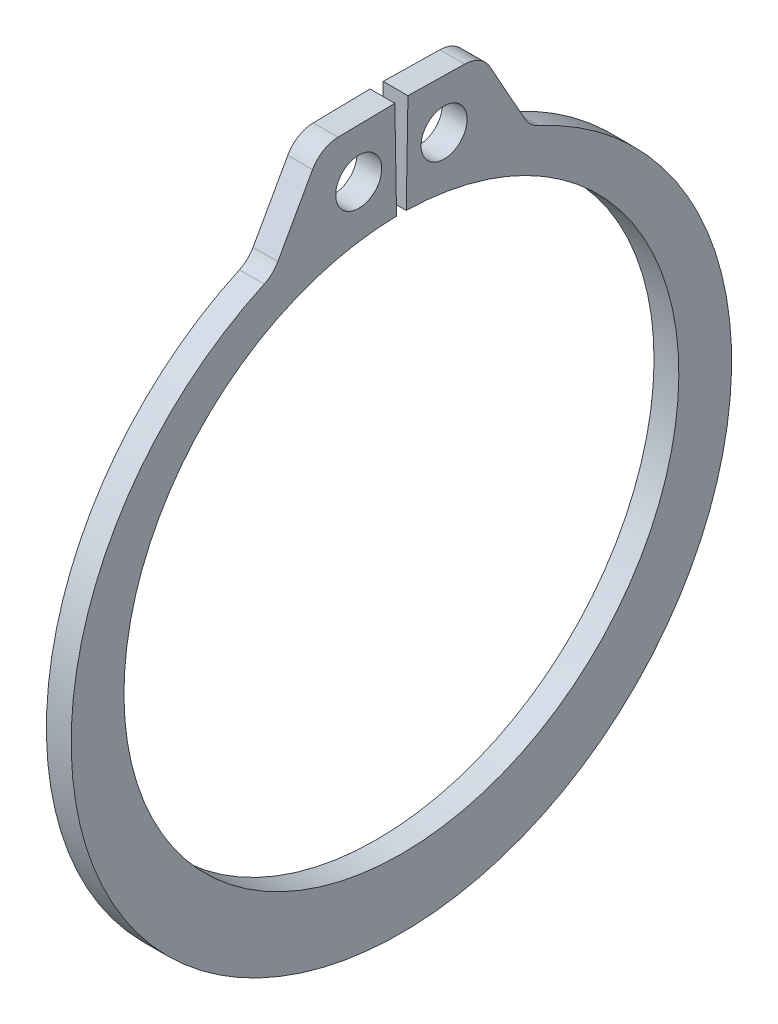
ISO-10303-21;
HEADER;
FILE_DESCRIPTION(('STEP AP214'),'2;1');
FILE_NAME('part.step','',(''),(''),'','','');
FILE_SCHEMA(('AUTOMOTIVE_DESIGN { 1 0 10303 214 1 1 1 1 }'));
ENDSEC;
DATA;
#1=APPLICATION_CONTEXT('core data for automotive mechanical design processes');
#2=APPLICATION_PROTOCOL_DEFINITION('international standard','automotive_design',2000,#1);
#3=PRODUCT_CONTEXT('',#1,'mechanical');
#4=PRODUCT('Part','Part','',(#3));
#5=PRODUCT_RELATED_PRODUCT_CATEGORY('part','',(#4));
#6=PRODUCT_DEFINITION_FORMATION('','',#4);
#7=PRODUCT_DEFINITION_CONTEXT('part definition',#1,'design');
#8=PRODUCT_DEFINITION('design','',#6,#7);
#9=PRODUCT_DEFINITION_SHAPE('','',#8);
#10=(LENGTH_UNIT() NAMED_UNIT(*) SI_UNIT(.MILLI.,.METRE.));
#11=(NAMED_UNIT(*) PLANE_ANGLE_UNIT() SI_UNIT($,.RADIAN.));
#12=(NAMED_UNIT(*) SI_UNIT($,.STERADIAN.) SOLID_ANGLE_UNIT());
#13=UNCERTAINTY_MEASURE_WITH_UNIT(LENGTH_MEASURE(1.E-05),#10,'distance_accuracy_value','');
#14=(GEOMETRIC_REPRESENTATION_CONTEXT(3) GLOBAL_UNCERTAINTY_ASSIGNED_CONTEXT((#13)) GLOBAL_UNIT_ASSIGNED_CONTEXT((#10,
#11,#12)) REPRESENTATION_CONTEXT('',''));
#15=CARTESIAN_POINT('',(0.,0.,0.));
#16=DIRECTION('',(0.,0.,1.));
#17=DIRECTION('',(1.,0.,0.));
#18=AXIS2_PLACEMENT_3D('',#15,#16,#17);
#19=CARTESIAN_POINT('',(0.5334,0.,0.));
#20=DIRECTION('',(1.,0.,0.));
#21=DIRECTION('',(0.,0.,-1.));
#22=AXIS2_PLACEMENT_3D('',#19,#20,#21);
#23=PLANE('',#22);
#24=CARTESIAN_POINT('',(0.5334,14.0289976548246,1.83579436935402));
#25=DIRECTION('',(1.,0.,0.));
#26=DIRECTION('',(0.,0.,-1.));
#27=AXIS2_PLACEMENT_3D('',#24,#25,#26);
#28=CIRCLE('',#27,0.9906);
#29=CARTESIAN_POINT('',(0.5334,14.0289976548246,0.84519436935402));
#30=VERTEX_POINT('',#29);
#31=EDGE_CURVE('E221',#30,#30,#28,.T.);
#32=ORIENTED_EDGE('',*,*,#31,.F.);
#33=EDGE_LOOP('',(#32));
#34=FACE_BOUND('',#33,.T.);
#35=DIRECTION('',(0.,-0.017452406437284,0.999847695156391));
#36=VECTOR('',#35,1.);
#37=CARTESIAN_POINT('',(0.5334,16.1773357380914,0.282376445673961));
#38=LINE('',#37,#36);
#39=CARTESIAN_POINT('',(0.5334,16.1773357380914,0.282376445673961));
#40=VERTEX_POINT('',#39);
#41=CARTESIAN_POINT('',(0.5334,16.1347155748455,2.72408396272631));
#42=VERTEX_POINT('',#41);
#43=EDGE_CURVE('E133',#40,#42,#38,.T.);
#44=ORIENTED_EDGE('',*,*,#43,.T.);
#45=CARTESIAN_POINT('',(0.5334,14.8522109362684,2.7016977609892));
#46=DIRECTION('',(1.,0.,0.));
#47=DIRECTION('',(0.,0.,-1.));
#48=AXIS2_PLACEMENT_3D('',#45,#46,#47);
#49=CIRCLE('',#48,1.2827);
#50=CARTESIAN_POINT('',(0.5334,15.4757773752687,3.82262781507487));
#51=VERTEX_POINT('',#50);
#52=EDGE_CURVE('E174',#42,#51,#49,.T.);
#53=ORIENTED_EDGE('',*,*,#52,.T.);
#54=DIRECTION('',(0.,-0.873883257258645,0.486135837686362));
#55=VECTOR('',#54,1.);
#56=CARTESIAN_POINT('',(0.5334,16.1218135248721,3.46324191065975));
#57=LINE('',#56,#55);
#58=CARTESIAN_POINT('',(0.5334,12.7919717875187,5.31561222317647));
#59=VERTEX_POINT('',#58);
#60=EDGE_CURVE('E213',#51,#59,#57,.T.);
#61=ORIENTED_EDGE('',*,*,#60,.T.);
#62=CARTESIAN_POINT('',(0.5334,13.415538226519,6.43654227726214));
#63=DIRECTION('',(1.,0.,0.));
#64=DIRECTION('',(0.,0.,-1.));
#65=AXIS2_PLACEMENT_3D('',#62,#63,#64);
#66=CIRCLE('',#65,1.2827);
#67=CARTESIAN_POINT('',(0.5334,12.2487956890074,5.90359655661022));
#68=VERTEX_POINT('',#67);
#69=EDGE_CURVE('E181',#59,#68,#66,.F.);
#70=ORIENTED_EDGE('',*,*,#69,.T.);
#71=CARTESIAN_POINT('',(0.5334,-0.675554690385856,0.));
#72=DIRECTION('',(1.,0.,0.));
#73=DIRECTION('',(0.,0.,-1.));
#74=AXIS2_PLACEMENT_3D('',#71,#72,#73);
#75=CIRCLE('',#74,14.2088453096141);
#76=CARTESIAN_POINT('',(0.5334,12.2487956890074,-5.90359655661022));
#77=VERTEX_POINT('',#76);
#78=EDGE_CURVE('E206',#68,#77,#75,.T.);
#79=ORIENTED_EDGE('',*,*,#78,.T.);
#80=CARTESIAN_POINT('',(0.5334,13.415538226519,-6.43654227726214));
#81=DIRECTION('',(1.,0.,0.));
#82=DIRECTION('',(0.,0.,-1.));
#83=AXIS2_PLACEMENT_3D('',#80,#81,#82);
#84=CIRCLE('',#83,1.2827);
#85=CARTESIAN_POINT('',(0.5334,12.7919717875187,-5.31561222317647));
#86=VERTEX_POINT('',#85);
#87=EDGE_CURVE('E11',#77,#86,#84,.F.);
#88=ORIENTED_EDGE('',*,*,#87,.T.);
#89=DIRECTION('',(0.,0.873883257258645,0.486135837686362));
#90=VECTOR('',#89,1.);
#91=CARTESIAN_POINT('',(0.5334,16.1218135248721,-3.46324191065975));
#92=LINE('',#91,#90);
#93=CARTESIAN_POINT('',(0.5334,15.4757773752687,-3.82262781507487));
#94=VERTEX_POINT('',#93);
#95=EDGE_CURVE('E205',#86,#94,#92,.T.);
#96=ORIENTED_EDGE('',*,*,#95,.T.);
#97=CARTESIAN_POINT('',(0.5334,14.8522109362684,-2.7016977609892));
#98=DIRECTION('',(1.,0.,0.));
#99=DIRECTION('',(0.,0.,-1.));
#100=AXIS2_PLACEMENT_3D('',#97,#98,#99);
#101=CIRCLE('',#100,1.2827);
#102=CARTESIAN_POINT('',(0.5334,16.1347155748455,-2.72408396272631));
#103=VERTEX_POINT('',#102);
#104=EDGE_CURVE('E49',#94,#103,#101,.T.);
#105=ORIENTED_EDGE('',*,*,#104,.T.);
#106=DIRECTION('',(0.,0.017452406437284,0.999847695156391));
#107=VECTOR('',#106,1.);
#108=CARTESIAN_POINT('',(0.5334,16.1773357380914,-0.282376445673961));
#109=LINE('',#108,#107);
#110=CARTESIAN_POINT('',(0.5334,16.1773357380914,-0.282376445673961));
#111=VERTEX_POINT('',#110);
#112=EDGE_CURVE('E210',#103,#111,#109,.T.);
#113=ORIENTED_EDGE('',*,*,#112,.T.);
#114=DIRECTION('',(0.,-0.999847695156391,0.0174524064372835));
#115=VECTOR('',#114,1.);
#116=CARTESIAN_POINT('',(0.5334,11.936181784777,-0.208346828048291));
#117=LINE('',#116,#115);
#118=CARTESIAN_POINT('',(0.5334,11.936181784777,-0.208346828048291));
#119=VERTEX_POINT('',#118);
#120=EDGE_CURVE('E139',#111,#119,#117,.T.);
#121=ORIENTED_EDGE('',*,*,#120,.T.);
#122=CARTESIAN_POINT('',(0.5334,0.,0.));
#123=DIRECTION('',(-1.,0.,0.));
#124=DIRECTION('',(0.,0.,-1.));
#125=AXIS2_PLACEMENT_3D('',#122,#123,#124);
#126=CIRCLE('',#125,11.938);
#127=CARTESIAN_POINT('',(0.5334,11.936181784777,0.208346828048291));
#128=VERTEX_POINT('',#127);
#129=EDGE_CURVE('E134',#119,#128,#126,.T.);
#130=ORIENTED_EDGE('',*,*,#129,.T.);
#131=DIRECTION('',(0.,0.999847695156391,0.0174524064372835));
#132=VECTOR('',#131,1.);
#133=CARTESIAN_POINT('',(0.5334,11.936181784777,0.208346828048291));
#134=LINE('',#133,#132);
#135=EDGE_CURVE('E125',#128,#40,#134,.T.);
#136=ORIENTED_EDGE('',*,*,#135,.T.);
#137=EDGE_LOOP('',(#44,#53,#61,#70,#79,#88,#96,#105,#113,#121,#130,#136));
#138=FACE_BOUND('',#137,.T.);
#139=CARTESIAN_POINT('',(0.5334,14.0289976548246,-1.83579436935402));
#140=DIRECTION('',(1.,0.,0.));
#141=DIRECTION('',(0.,0.,-1.));
#142=AXIS2_PLACEMENT_3D('',#139,#140,#141);
#143=CIRCLE('',#142,0.990600000000001);
#144=CARTESIAN_POINT('',(0.5334,14.0289976548246,-2.82639436935402));
#145=VERTEX_POINT('',#144);
#146=EDGE_CURVE('E247',#145,#145,#143,.T.);
#147=ORIENTED_EDGE('',*,*,#146,.F.);
#148=EDGE_LOOP('',(#147));
#149=FACE_BOUND('',#148,.T.);
#150=ADVANCED_FACE('F34',(#34,#138,#149),#23,.T.);
#151=CARTESIAN_POINT('',(-0.5334,0.,0.));
#152=DIRECTION('',(1.,0.,0.));
#153=DIRECTION('',(0.,0.,-1.));
#154=AXIS2_PLACEMENT_3D('',#151,#152,#153);
#155=PLANE('',#154);
#156=CARTESIAN_POINT('',(-0.5334,14.0289976548246,1.83579436935402));
#157=DIRECTION('',(1.,0.,0.));
#158=DIRECTION('',(0.,0.,-1.));
#159=AXIS2_PLACEMENT_3D('',#156,#157,#158);
#160=CIRCLE('',#159,0.9906);
#161=CARTESIAN_POINT('',(-0.5334,14.0289976548246,0.84519436935402));
#162=VERTEX_POINT('',#161);
#163=EDGE_CURVE('E244',#162,#162,#160,.T.);
#164=ORIENTED_EDGE('',*,*,#163,.T.);
#165=EDGE_LOOP('',(#164));
#166=FACE_BOUND('',#165,.T.);
#167=DIRECTION('',(0.,-0.873883257258645,0.486135837686362));
#168=VECTOR('',#167,1.);
#169=CARTESIAN_POINT('',(-0.5334,16.1218135248721,3.46324191065975));
#170=LINE('',#169,#168);
#171=CARTESIAN_POINT('',(-0.5334,15.4757773752687,3.82262781507487));
#172=VERTEX_POINT('',#171);
#173=CARTESIAN_POINT('',(-0.5334,12.7919717875187,5.31561222317647));
#174=VERTEX_POINT('',#173);
#175=EDGE_CURVE('E200',#172,#174,#170,.T.);
#176=ORIENTED_EDGE('',*,*,#175,.F.);
#177=CARTESIAN_POINT('',(-0.5334,14.8522109362684,2.7016977609892));
#178=DIRECTION('',(1.,0.,0.));
#179=DIRECTION('',(0.,0.,-1.));
#180=AXIS2_PLACEMENT_3D('',#177,#178,#179);
#181=CIRCLE('',#180,1.2827);
#182=CARTESIAN_POINT('',(-0.5334,16.1347155748455,2.72408396272631));
#183=VERTEX_POINT('',#182);
#184=EDGE_CURVE('E170',#172,#183,#181,.F.);
#185=ORIENTED_EDGE('',*,*,#184,.T.);
#186=DIRECTION('',(0.,-0.017452406437284,0.999847695156391));
#187=VECTOR('',#186,1.);
#188=CARTESIAN_POINT('',(-0.5334,16.1773357380914,0.282376445673961));
#189=LINE('',#188,#187);
#190=CARTESIAN_POINT('',(-0.5334,16.1773357380914,0.282376445673961));
#191=VERTEX_POINT('',#190);
#192=EDGE_CURVE('E223',#191,#183,#189,.T.);
#193=ORIENTED_EDGE('',*,*,#192,.F.);
#194=DIRECTION('',(0.,0.999847695156391,0.0174524064372835));
#195=VECTOR('',#194,1.);
#196=CARTESIAN_POINT('',(-0.5334,11.936181784777,0.208346828048291));
#197=LINE('',#196,#195);
#198=CARTESIAN_POINT('',(-0.5334,11.936181784777,0.208346828048291));
#199=VERTEX_POINT('',#198);
#200=EDGE_CURVE('E220',#199,#191,#197,.T.);
#201=ORIENTED_EDGE('',*,*,#200,.F.);
#202=CARTESIAN_POINT('',(-0.5334,0.,0.));
#203=DIRECTION('',(-1.,0.,0.));
#204=DIRECTION('',(0.,0.,-1.));
#205=AXIS2_PLACEMENT_3D('',#202,#203,#204);
#206=CIRCLE('',#205,11.938);
#207=CARTESIAN_POINT('',(-0.5334,11.936181784777,-0.208346828048291));
#208=VERTEX_POINT('',#207);
#209=EDGE_CURVE('E147',#208,#199,#206,.T.);
#210=ORIENTED_EDGE('',*,*,#209,.F.);
#211=DIRECTION('',(0.,-0.999847695156391,0.0174524064372835));
#212=VECTOR('',#211,1.);
#213=CARTESIAN_POINT('',(-0.5334,11.936181784777,-0.208346828048291));
#214=LINE('',#213,#212);
#215=CARTESIAN_POINT('',(-0.5334,16.1773357380914,-0.282376445673961));
#216=VERTEX_POINT('',#215);
#217=EDGE_CURVE('E143',#216,#208,#214,.T.);
#218=ORIENTED_EDGE('',*,*,#217,.F.);
#219=DIRECTION('',(0.,0.017452406437284,0.999847695156391));
#220=VECTOR('',#219,1.);
#221=CARTESIAN_POINT('',(-0.5334,16.1773357380914,-0.282376445673961));
#222=LINE('',#221,#220);
#223=CARTESIAN_POINT('',(-0.5334,16.1347155748455,-2.72408396272631));
#224=VERTEX_POINT('',#223);
#225=EDGE_CURVE('E228',#224,#216,#222,.T.);
#226=ORIENTED_EDGE('',*,*,#225,.F.);
#227=CARTESIAN_POINT('',(-0.5334,14.8522109362684,-2.7016977609892));
#228=DIRECTION('',(1.,0.,0.));
#229=DIRECTION('',(0.,0.,-1.));
#230=AXIS2_PLACEMENT_3D('',#227,#228,#229);
#231=CIRCLE('',#230,1.2827);
#232=CARTESIAN_POINT('',(-0.5334,15.4757773752687,-3.82262781507487));
#233=VERTEX_POINT('',#232);
#234=EDGE_CURVE('E168',#224,#233,#231,.F.);
#235=ORIENTED_EDGE('',*,*,#234,.T.);
#236=DIRECTION('',(0.,0.873883257258645,0.486135837686362));
#237=VECTOR('',#236,1.);
#238=CARTESIAN_POINT('',(-0.5334,16.1218135248721,-3.46324191065975));
#239=LINE('',#238,#237);
#240=CARTESIAN_POINT('',(-0.5334,12.7919717875187,-5.31561222317647));
#241=VERTEX_POINT('',#240);
#242=EDGE_CURVE('E191',#241,#233,#239,.T.);
#243=ORIENTED_EDGE('',*,*,#242,.F.);
#244=CARTESIAN_POINT('',(-0.5334,13.415538226519,-6.43654227726214));
#245=DIRECTION('',(1.,0.,0.));
#246=DIRECTION('',(0.,0.,-1.));
#247=AXIS2_PLACEMENT_3D('',#244,#245,#246);
#248=CIRCLE('',#247,1.2827);
#249=CARTESIAN_POINT('',(-0.5334,12.2487956890074,-5.90359655661022));
#250=VERTEX_POINT('',#249);
#251=EDGE_CURVE('E42',#241,#250,#248,.T.);
#252=ORIENTED_EDGE('',*,*,#251,.T.);
#253=CARTESIAN_POINT('',(-0.5334,-0.675554690385856,0.));
#254=DIRECTION('',(1.,0.,0.));
#255=DIRECTION('',(0.,0.,-1.));
#256=AXIS2_PLACEMENT_3D('',#253,#254,#255);
#257=CIRCLE('',#256,14.2088453096141);
#258=CARTESIAN_POINT('',(-0.5334,12.2487956890074,5.90359655661022));
#259=VERTEX_POINT('',#258);
#260=EDGE_CURVE('E189',#259,#250,#257,.T.);
#261=ORIENTED_EDGE('',*,*,#260,.F.);
#262=CARTESIAN_POINT('',(-0.5334,13.415538226519,6.43654227726214));
#263=DIRECTION('',(1.,0.,0.));
#264=DIRECTION('',(0.,0.,-1.));
#265=AXIS2_PLACEMENT_3D('',#262,#263,#264);
#266=CIRCLE('',#265,1.2827);
#267=EDGE_CURVE('E179',#259,#174,#266,.T.);
#268=ORIENTED_EDGE('',*,*,#267,.T.);
#269=EDGE_LOOP('',(#176,#185,#193,#201,#210,#218,#226,#235,#243,#252,#261,#268));
#270=FACE_BOUND('',#269,.T.);
#271=CARTESIAN_POINT('',(-0.5334,14.0289976548246,-1.83579436935402));
#272=DIRECTION('',(1.,0.,0.));
#273=DIRECTION('',(0.,0.,-1.));
#274=AXIS2_PLACEMENT_3D('',#271,#272,#273);
#275=CIRCLE('',#274,0.990600000000001);
#276=CARTESIAN_POINT('',(-0.5334,14.0289976548246,-2.82639436935402));
#277=VERTEX_POINT('',#276);
#278=EDGE_CURVE('E250',#277,#277,#275,.T.);
#279=ORIENTED_EDGE('',*,*,#278,.T.);
#280=EDGE_LOOP('',(#279));
#281=FACE_BOUND('',#280,.T.);
#282=ADVANCED_FACE('F187',(#166,#270,#281),#155,.F.);
#283=CARTESIAN_POINT('',(0.5334,0.,0.));
#284=DIRECTION('',(-1.,0.,0.));
#285=DIRECTION('',(0.,0.,1.));
#286=AXIS2_PLACEMENT_3D('',#283,#284,#285);
#287=CYLINDRICAL_SURFACE('',#286,11.938);
#288=ORIENTED_EDGE('',*,*,#209,.T.);
#289=DIRECTION('',(-1.,0.,0.));
#290=VECTOR('',#289,1.);
#291=CARTESIAN_POINT('',(0.5334,11.936181784777,0.208346828048291));
#292=LINE('',#291,#290);
#293=EDGE_CURVE('E129',#128,#199,#292,.T.);
#294=ORIENTED_EDGE('',*,*,#293,.F.);
#295=ORIENTED_EDGE('',*,*,#129,.F.);
#296=DIRECTION('',(-1.,0.,0.));
#297=VECTOR('',#296,1.);
#298=CARTESIAN_POINT('',(0.5334,11.936181784777,-0.208346828048291));
#299=LINE('',#298,#297);
#300=EDGE_CURVE('E218',#119,#208,#299,.T.);
#301=ORIENTED_EDGE('',*,*,#300,.T.);
#302=EDGE_LOOP('',(#288,#294,#295,#301));
#303=FACE_BOUND('',#302,.T.);
#304=ADVANCED_FACE('F145',(#303),#287,.F.);
#305=CARTESIAN_POINT('',(0.5334,11.936181784777,0.208346828048291));
#306=DIRECTION('',(0.,-0.0174524064372835,0.999847695156391));
#307=DIRECTION('',(0.,-0.999847695156391,-0.0174524064372835));
#308=AXIS2_PLACEMENT_3D('',#305,#306,#307);
#309=PLANE('',#308);
#310=ORIENTED_EDGE('',*,*,#200,.T.);
#311=DIRECTION('',(-1.,0.,0.));
#312=VECTOR('',#311,1.);
#313=CARTESIAN_POINT('',(0.5334,16.1773357380914,0.282376445673961));
#314=LINE('',#313,#312);
#315=EDGE_CURVE('E132',#40,#191,#314,.T.);
#316=ORIENTED_EDGE('',*,*,#315,.F.);
#317=ORIENTED_EDGE('',*,*,#135,.F.);
#318=ORIENTED_EDGE('',*,*,#293,.T.);
#319=EDGE_LOOP('',(#310,#316,#317,#318));
#320=FACE_BOUND('',#319,.T.);
#321=ADVANCED_FACE('F127',(#320),#309,.F.);
#322=CARTESIAN_POINT('',(0.5334,16.1773357380914,0.282376445673961));
#323=DIRECTION('',(0.,-0.999847695156391,-0.017452406437284));
#324=DIRECTION('',(0.,0.017452406437284,-0.999847695156391));
#325=AXIS2_PLACEMENT_3D('',#322,#323,#324);
#326=PLANE('',#325);
#327=ORIENTED_EDGE('',*,*,#192,.T.);
#328=DIRECTION('',(-1.,0.,0.));
#329=VECTOR('',#328,1.);
#330=CARTESIAN_POINT('',(0.5334,16.1347155748455,2.72408396272631));
#331=LINE('',#330,#329);
#332=EDGE_CURVE('E57',#183,#42,#331,.F.);
#333=ORIENTED_EDGE('',*,*,#332,.T.);
#334=ORIENTED_EDGE('',*,*,#43,.F.);
#335=ORIENTED_EDGE('',*,*,#315,.T.);
#336=EDGE_LOOP('',(#327,#333,#334,#335));
#337=FACE_BOUND('',#336,.T.);
#338=ADVANCED_FACE('F239',(#337),#326,.F.);
#339=CARTESIAN_POINT('',(0.5334,16.1218135248721,3.46324191065975));
#340=DIRECTION('',(0.,-0.486135837686362,-0.873883257258645));
#341=DIRECTION('',(0.,0.873883257258645,-0.486135837686362));
#342=AXIS2_PLACEMENT_3D('',#339,#340,#341);
#343=PLANE('',#342);
#344=ORIENTED_EDGE('',*,*,#175,.T.);
#345=DIRECTION('',(1.,0.,0.));
#346=VECTOR('',#345,1.);
#347=CARTESIAN_POINT('',(0.5334,12.7919717875187,5.31561222317647));
#348=LINE('',#347,#346);
#349=EDGE_CURVE('E161',#174,#59,#348,.T.);
#350=ORIENTED_EDGE('',*,*,#349,.T.);
#351=ORIENTED_EDGE('',*,*,#60,.F.);
#352=DIRECTION('',(-1.,0.,0.));
#353=VECTOR('',#352,1.);
#354=CARTESIAN_POINT('',(0.5334,15.4757773752687,3.82262781507487));
#355=LINE('',#354,#353);
#356=EDGE_CURVE('E158',#51,#172,#355,.T.);
#357=ORIENTED_EDGE('',*,*,#356,.T.);
#358=EDGE_LOOP('',(#344,#350,#351,#357));
#359=FACE_BOUND('',#358,.T.);
#360=ADVANCED_FACE('F280',(#359),#343,.F.);
#361=CARTESIAN_POINT('',(0.5334,-0.675554690385856,0.));
#362=DIRECTION('',(-1.,0.,0.));
#363=DIRECTION('',(0.,0.,1.));
#364=AXIS2_PLACEMENT_3D('',#361,#362,#363);
#365=CYLINDRICAL_SURFACE('',#364,14.2088453096141);
#366=ORIENTED_EDGE('',*,*,#78,.F.);
#367=DIRECTION('',(-1.,0.,0.));
#368=VECTOR('',#367,1.);
#369=CARTESIAN_POINT('',(0.5334,12.2487956890074,5.90359655661022));
#370=LINE('',#369,#368);
#371=EDGE_CURVE('E150',#68,#259,#370,.T.);
#372=ORIENTED_EDGE('',*,*,#371,.T.);
#373=ORIENTED_EDGE('',*,*,#260,.T.);
#374=DIRECTION('',(-1.,0.,0.));
#375=VECTOR('',#374,1.);
#376=CARTESIAN_POINT('',(0.5334,12.2487956890074,-5.90359655661022));
#377=LINE('',#376,#375);
#378=EDGE_CURVE('E148',#250,#77,#377,.F.);
#379=ORIENTED_EDGE('',*,*,#378,.T.);
#380=EDGE_LOOP('',(#366,#372,#373,#379));
#381=FACE_BOUND('',#380,.T.);
#382=ADVANCED_FACE('F197',(#381),#365,.T.);
#383=CARTESIAN_POINT('',(0.5334,16.1218135248721,-3.46324191065975));
#384=DIRECTION('',(0.,-0.486135837686362,0.873883257258645));
#385=DIRECTION('',(0.,-0.873883257258645,-0.486135837686362));
#386=AXIS2_PLACEMENT_3D('',#383,#384,#385);
#387=PLANE('',#386);
#388=ORIENTED_EDGE('',*,*,#95,.F.);
#389=DIRECTION('',(1.,0.,0.));
#390=VECTOR('',#389,1.);
#391=CARTESIAN_POINT('',(-0.5334,12.7919717875187,-5.31561222317647));
#392=LINE('',#391,#390);
#393=EDGE_CURVE('E165',#86,#241,#392,.F.);
#394=ORIENTED_EDGE('',*,*,#393,.T.);
#395=ORIENTED_EDGE('',*,*,#242,.T.);
#396=DIRECTION('',(-1.,0.,0.));
#397=VECTOR('',#396,1.);
#398=CARTESIAN_POINT('',(0.5334,15.4757773752687,-3.82262781507487));
#399=LINE('',#398,#397);
#400=EDGE_CURVE('E163',#233,#94,#399,.F.);
#401=ORIENTED_EDGE('',*,*,#400,.T.);
#402=EDGE_LOOP('',(#388,#394,#395,#401));
#403=FACE_BOUND('',#402,.T.);
#404=ADVANCED_FACE('F208',(#403),#387,.F.);
#405=CARTESIAN_POINT('',(0.5334,16.1773357380914,-0.282376445673961));
#406=DIRECTION('',(0.,-0.999847695156391,0.017452406437284));
#407=DIRECTION('',(0.,-0.017452406437284,-0.999847695156391));
#408=AXIS2_PLACEMENT_3D('',#405,#406,#407);
#409=PLANE('',#408);
#410=ORIENTED_EDGE('',*,*,#112,.F.);
#411=DIRECTION('',(-1.,0.,0.));
#412=VECTOR('',#411,1.);
#413=CARTESIAN_POINT('',(0.5334,16.1347155748455,-2.72408396272631));
#414=LINE('',#413,#412);
#415=EDGE_CURVE('E176',#103,#224,#414,.T.);
#416=ORIENTED_EDGE('',*,*,#415,.T.);
#417=ORIENTED_EDGE('',*,*,#225,.T.);
#418=DIRECTION('',(-1.,0.,0.));
#419=VECTOR('',#418,1.);
#420=CARTESIAN_POINT('',(0.5334,16.1773357380914,-0.282376445673961));
#421=LINE('',#420,#419);
#422=EDGE_CURVE('E152',#111,#216,#421,.T.);
#423=ORIENTED_EDGE('',*,*,#422,.F.);
#424=EDGE_LOOP('',(#410,#416,#417,#423));
#425=FACE_BOUND('',#424,.T.);
#426=ADVANCED_FACE('F273',(#425),#409,.F.);
#427=CARTESIAN_POINT('',(0.5334,11.936181784777,-0.208346828048291));
#428=DIRECTION('',(0.,-0.0174524064372835,-0.999847695156391));
#429=DIRECTION('',(0.,0.999847695156391,-0.0174524064372835));
#430=AXIS2_PLACEMENT_3D('',#427,#428,#429);
#431=PLANE('',#430);
#432=ORIENTED_EDGE('',*,*,#217,.T.);
#433=ORIENTED_EDGE('',*,*,#300,.F.);
#434=ORIENTED_EDGE('',*,*,#120,.F.);
#435=ORIENTED_EDGE('',*,*,#422,.T.);
#436=EDGE_LOOP('',(#432,#433,#434,#435));
#437=FACE_BOUND('',#436,.T.);
#438=ADVANCED_FACE('F235',(#437),#431,.F.);
#439=CARTESIAN_POINT('',(0.5334,14.0289976548246,1.83579436935402));
#440=DIRECTION('',(-1.,0.,0.));
#441=DIRECTION('',(0.,0.,1.));
#442=AXIS2_PLACEMENT_3D('',#439,#440,#441);
#443=CYLINDRICAL_SURFACE('',#442,0.9906);
#444=ORIENTED_EDGE('',*,*,#31,.T.);
#445=EDGE_LOOP('',(#444));
#446=FACE_BOUND('',#445,.T.);
#447=ORIENTED_EDGE('',*,*,#163,.F.);
#448=EDGE_LOOP('',(#447));
#449=FACE_BOUND('',#448,.T.);
#450=ADVANCED_FACE('F268',(#446,#449),#443,.F.);
#451=CARTESIAN_POINT('',(0.5334,14.0289976548246,-1.83579436935402));
#452=DIRECTION('',(-1.,0.,0.));
#453=DIRECTION('',(0.,0.,1.));
#454=AXIS2_PLACEMENT_3D('',#451,#452,#453);
#455=CYLINDRICAL_SURFACE('',#454,0.990600000000001);
#456=ORIENTED_EDGE('',*,*,#146,.T.);
#457=EDGE_LOOP('',(#456));
#458=FACE_BOUND('',#457,.T.);
#459=ORIENTED_EDGE('',*,*,#278,.F.);
#460=EDGE_LOOP('',(#459));
#461=FACE_BOUND('',#460,.T.);
#462=ADVANCED_FACE('F256',(#458,#461),#455,.F.);
#463=CARTESIAN_POINT('',(0.5334,13.415538226519,6.43654227726214));
#464=DIRECTION('',(-1.,0.,0.));
#465=DIRECTION('',(0.,0.,1.));
#466=AXIS2_PLACEMENT_3D('',#463,#464,#465);
#467=CYLINDRICAL_SURFACE('',#466,1.2827);
#468=ORIENTED_EDGE('',*,*,#69,.F.);
#469=ORIENTED_EDGE('',*,*,#349,.F.);
#470=ORIENTED_EDGE('',*,*,#267,.F.);
#471=ORIENTED_EDGE('',*,*,#371,.F.);
#472=EDGE_LOOP('',(#468,#469,#470,#471));
#473=FACE_BOUND('',#472,.T.);
#474=ADVANCED_FACE('F290',(#473),#467,.F.);
#475=CARTESIAN_POINT('',(0.5334,13.415538226519,-6.43654227726214));
#476=DIRECTION('',(-1.,0.,0.));
#477=DIRECTION('',(0.,0.,1.));
#478=AXIS2_PLACEMENT_3D('',#475,#476,#477);
#479=CYLINDRICAL_SURFACE('',#478,1.2827);
#480=ORIENTED_EDGE('',*,*,#87,.F.);
#481=ORIENTED_EDGE('',*,*,#378,.F.);
#482=ORIENTED_EDGE('',*,*,#251,.F.);
#483=ORIENTED_EDGE('',*,*,#393,.F.);
#484=EDGE_LOOP('',(#480,#481,#482,#483));
#485=FACE_BOUND('',#484,.T.);
#486=ADVANCED_FACE('F203',(#485),#479,.F.);
#487=CARTESIAN_POINT('',(0.5334,14.8522109362684,2.7016977609892));
#488=DIRECTION('',(-1.,0.,0.));
#489=DIRECTION('',(0.,0.,1.));
#490=AXIS2_PLACEMENT_3D('',#487,#488,#489);
#491=CYLINDRICAL_SURFACE('',#490,1.2827);
#492=ORIENTED_EDGE('',*,*,#52,.F.);
#493=ORIENTED_EDGE('',*,*,#332,.F.);
#494=ORIENTED_EDGE('',*,*,#184,.F.);
#495=ORIENTED_EDGE('',*,*,#356,.F.);
#496=EDGE_LOOP('',(#492,#493,#494,#495));
#497=FACE_BOUND('',#496,.T.);
#498=ADVANCED_FACE('F295',(#497),#491,.T.);
#499=CARTESIAN_POINT('',(0.5334,14.8522109362684,-2.7016977609892));
#500=DIRECTION('',(-1.,0.,0.));
#501=DIRECTION('',(0.,0.,1.));
#502=AXIS2_PLACEMENT_3D('',#499,#500,#501);
#503=CYLINDRICAL_SURFACE('',#502,1.2827);
#504=ORIENTED_EDGE('',*,*,#104,.F.);
#505=ORIENTED_EDGE('',*,*,#400,.F.);
#506=ORIENTED_EDGE('',*,*,#234,.F.);
#507=ORIENTED_EDGE('',*,*,#415,.F.);
#508=EDGE_LOOP('',(#504,#505,#506,#507));
#509=FACE_BOUND('',#508,.T.);
#510=ADVANCED_FACE('F36',(#509),#503,.T.);
#511=CLOSED_SHELL('',(#150,#282,#304,#321,#338,#360,#382,#404,#426,#438,#450,#462,#474,#486,
#498,#510));
#512=MANIFOLD_SOLID_BREP('B2',#511);
#513=ADVANCED_BREP_SHAPE_REPRESENTATION('',(#18,#512),#14);
#514=SHAPE_DEFINITION_REPRESENTATION(#9,#513);
ENDSEC;
END-ISO-10303-21;
